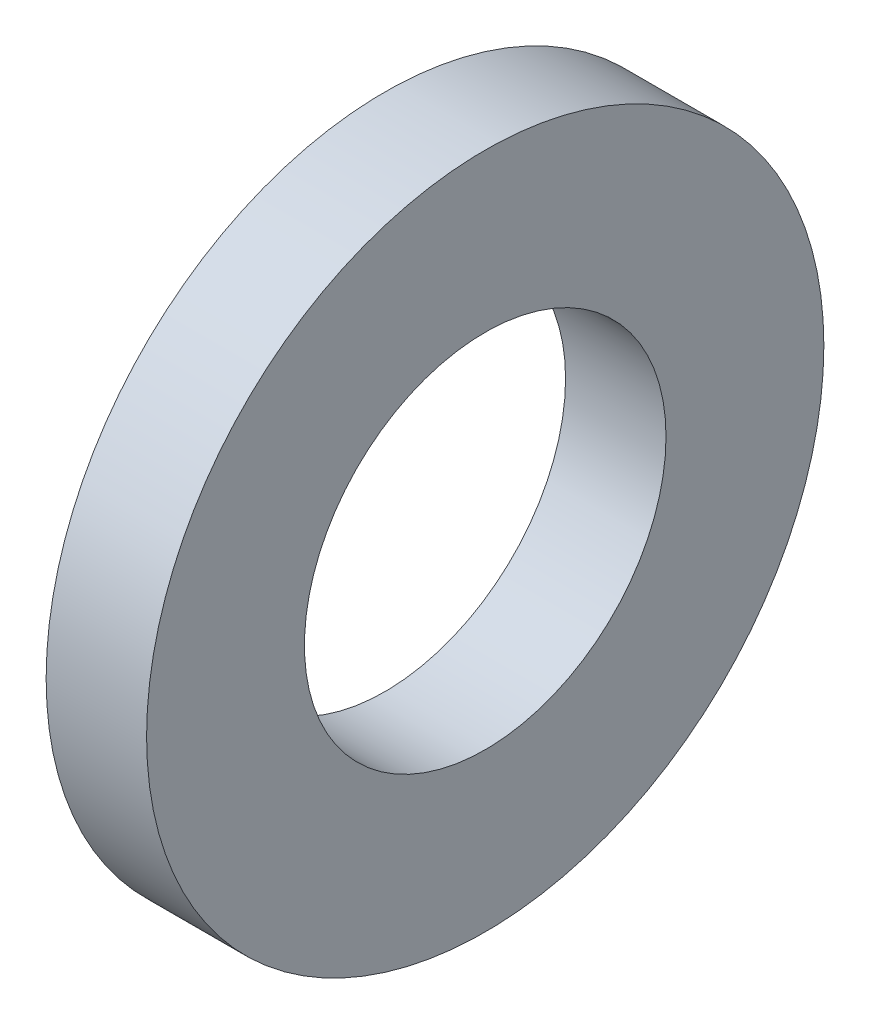
ISO-10303-21;
HEADER;
FILE_DESCRIPTION(('STEP AP214'),'2;1');
FILE_NAME('part.step','',(''),(''),'','','');
FILE_SCHEMA(('AUTOMOTIVE_DESIGN { 1 0 10303 214 1 1 1 1 }'));
ENDSEC;
DATA;
#1=APPLICATION_CONTEXT('core data for automotive mechanical design processes');
#2=APPLICATION_PROTOCOL_DEFINITION('international standard','automotive_design',2000,#1);
#3=PRODUCT_CONTEXT('',#1,'mechanical');
#4=PRODUCT('Part','Part','',(#3));
#5=PRODUCT_RELATED_PRODUCT_CATEGORY('part','',(#4));
#6=PRODUCT_DEFINITION_FORMATION('','',#4);
#7=PRODUCT_DEFINITION_CONTEXT('part definition',#1,'design');
#8=PRODUCT_DEFINITION('design','',#6,#7);
#9=PRODUCT_DEFINITION_SHAPE('','',#8);
#10=(LENGTH_UNIT() NAMED_UNIT(*) SI_UNIT(.MILLI.,.METRE.));
#11=(NAMED_UNIT(*) PLANE_ANGLE_UNIT() SI_UNIT($,.RADIAN.));
#12=(NAMED_UNIT(*) SI_UNIT($,.STERADIAN.) SOLID_ANGLE_UNIT());
#13=UNCERTAINTY_MEASURE_WITH_UNIT(LENGTH_MEASURE(1.E-05),#10,'distance_accuracy_value','');
#14=(GEOMETRIC_REPRESENTATION_CONTEXT(3) GLOBAL_UNCERTAINTY_ASSIGNED_CONTEXT((#13)) GLOBAL_UNIT_ASSIGNED_CONTEXT((#10,
#11,#12)) REPRESENTATION_CONTEXT('',''));
#15=CARTESIAN_POINT('',(0.,0.,0.));
#16=DIRECTION('',(0.,0.,1.));
#17=DIRECTION('',(1.,0.,0.));
#18=AXIS2_PLACEMENT_3D('',#15,#16,#17);
#19=CARTESIAN_POINT('',(1.778,0.,0.));
#20=DIRECTION('',(1.,0.,0.));
#21=DIRECTION('',(0.,0.,-1.));
#22=AXIS2_PLACEMENT_3D('',#19,#20,#21);
#23=PLANE('',#22);
#24=CARTESIAN_POINT('',(1.778,0.,0.));
#25=DIRECTION('',(1.,0.,0.));
#26=DIRECTION('',(0.,0.,-1.));
#27=AXIS2_PLACEMENT_3D('',#24,#25,#26);
#28=CIRCLE('',#27,5.9944);
#29=CARTESIAN_POINT('',(1.778,0.,-5.9944));
#30=VERTEX_POINT('',#29);
#31=EDGE_CURVE('E10',#30,#30,#28,.T.);
#32=ORIENTED_EDGE('',*,*,#31,.T.);
#33=EDGE_LOOP('',(#32));
#34=FACE_BOUND('',#33,.T.);
#35=CARTESIAN_POINT('',(1.778,0.,0.));
#36=DIRECTION('',(1.,0.,0.));
#37=DIRECTION('',(0.,0.,-1.));
#38=AXIS2_PLACEMENT_3D('',#35,#36,#37);
#39=CIRCLE('',#38,3.2004);
#40=CARTESIAN_POINT('',(1.778,0.,-3.2004));
#41=VERTEX_POINT('',#40);
#42=EDGE_CURVE('E41',#41,#41,#39,.T.);
#43=ORIENTED_EDGE('',*,*,#42,.F.);
#44=EDGE_LOOP('',(#43));
#45=FACE_BOUND('',#44,.T.);
#46=ADVANCED_FACE('F30',(#34,#45),#23,.T.);
#47=CARTESIAN_POINT('',(0.,0.,0.));
#48=DIRECTION('',(1.,0.,0.));
#49=DIRECTION('',(0.,0.,-1.));
#50=AXIS2_PLACEMENT_3D('',#47,#48,#49);
#51=PLANE('',#50);
#52=CARTESIAN_POINT('',(0.,0.,0.));
#53=DIRECTION('',(1.,0.,0.));
#54=DIRECTION('',(0.,0.,-1.));
#55=AXIS2_PLACEMENT_3D('',#52,#53,#54);
#56=CIRCLE('',#55,5.9944);
#57=CARTESIAN_POINT('',(0.,0.,-5.9944));
#58=VERTEX_POINT('',#57);
#59=EDGE_CURVE('E34',#58,#58,#56,.T.);
#60=ORIENTED_EDGE('',*,*,#59,.F.);
#61=EDGE_LOOP('',(#60));
#62=FACE_BOUND('',#61,.T.);
#63=CARTESIAN_POINT('',(0.,0.,0.));
#64=DIRECTION('',(1.,0.,0.));
#65=DIRECTION('',(0.,0.,-1.));
#66=AXIS2_PLACEMENT_3D('',#63,#64,#65);
#67=CIRCLE('',#66,3.2004);
#68=CARTESIAN_POINT('',(0.,0.,-3.2004));
#69=VERTEX_POINT('',#68);
#70=EDGE_CURVE('E43',#69,#69,#67,.T.);
#71=ORIENTED_EDGE('',*,*,#70,.T.);
#72=EDGE_LOOP('',(#71));
#73=FACE_BOUND('',#72,.T.);
#74=ADVANCED_FACE('F53',(#62,#73),#51,.F.);
#75=CARTESIAN_POINT('',(1.778,0.,0.));
#76=DIRECTION('',(-1.,0.,0.));
#77=DIRECTION('',(0.,0.,1.));
#78=AXIS2_PLACEMENT_3D('',#75,#76,#77);
#79=CYLINDRICAL_SURFACE('',#78,5.9944);
#80=ORIENTED_EDGE('',*,*,#31,.F.);
#81=EDGE_LOOP('',(#80));
#82=FACE_BOUND('',#81,.T.);
#83=ORIENTED_EDGE('',*,*,#59,.T.);
#84=EDGE_LOOP('',(#83));
#85=FACE_BOUND('',#84,.T.);
#86=ADVANCED_FACE('F32',(#82,#85),#79,.T.);
#87=CARTESIAN_POINT('',(1.778,0.,0.));
#88=DIRECTION('',(-1.,0.,0.));
#89=DIRECTION('',(0.,0.,1.));
#90=AXIS2_PLACEMENT_3D('',#87,#88,#89);
#91=CYLINDRICAL_SURFACE('',#90,3.2004);
#92=ORIENTED_EDGE('',*,*,#42,.T.);
#93=EDGE_LOOP('',(#92));
#94=FACE_BOUND('',#93,.T.);
#95=ORIENTED_EDGE('',*,*,#70,.F.);
#96=EDGE_LOOP('',(#95));
#97=FACE_BOUND('',#96,.T.);
#98=ADVANCED_FACE('F49',(#94,#97),#91,.F.);
#99=CLOSED_SHELL('',(#46,#74,#86,#98));
#100=MANIFOLD_SOLID_BREP('B2',#99);
#101=ADVANCED_BREP_SHAPE_REPRESENTATION('',(#18,#100),#14);
#102=SHAPE_DEFINITION_REPRESENTATION(#9,#101);
ENDSEC;
END-ISO-10303-21;
